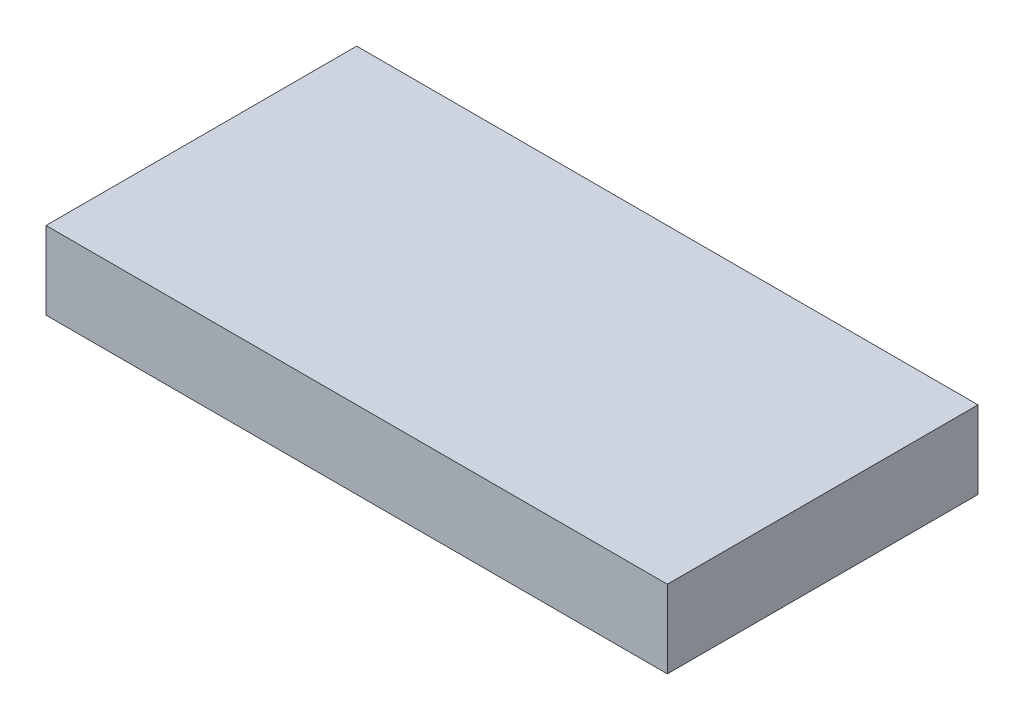
ISO-10303-21;
HEADER;
FILE_DESCRIPTION(('STEP AP214'),'2;1');
FILE_NAME('part.step','',(''),(''),'','','');
FILE_SCHEMA(('AUTOMOTIVE_DESIGN { 1 0 10303 214 1 1 1 1 }'));
ENDSEC;
DATA;
#1=APPLICATION_CONTEXT('core data for automotive mechanical design processes');
#2=APPLICATION_PROTOCOL_DEFINITION('international standard','automotive_design',2000,#1);
#3=PRODUCT_CONTEXT('',#1,'mechanical');
#4=PRODUCT('Part','Part','',(#3));
#5=PRODUCT_RELATED_PRODUCT_CATEGORY('part','',(#4));
#6=PRODUCT_DEFINITION_FORMATION('','',#4);
#7=PRODUCT_DEFINITION_CONTEXT('part definition',#1,'design');
#8=PRODUCT_DEFINITION('design','',#6,#7);
#9=PRODUCT_DEFINITION_SHAPE('','',#8);
#10=(LENGTH_UNIT() NAMED_UNIT(*) SI_UNIT(.MILLI.,.METRE.));
#11=(NAMED_UNIT(*) PLANE_ANGLE_UNIT() SI_UNIT($,.RADIAN.));
#12=(NAMED_UNIT(*) SI_UNIT($,.STERADIAN.) SOLID_ANGLE_UNIT());
#13=UNCERTAINTY_MEASURE_WITH_UNIT(LENGTH_MEASURE(1.E-05),#10,'distance_accuracy_value','');
#14=(GEOMETRIC_REPRESENTATION_CONTEXT(3) GLOBAL_UNCERTAINTY_ASSIGNED_CONTEXT((#13)) GLOBAL_UNIT_ASSIGNED_CONTEXT((#10,
#11,#12)) REPRESENTATION_CONTEXT('',''));
#15=CARTESIAN_POINT('',(0.,0.,0.));
#16=DIRECTION('',(0.,0.,1.));
#17=DIRECTION('',(1.,0.,0.));
#18=AXIS2_PLACEMENT_3D('',#15,#16,#17);
#19=CARTESIAN_POINT('',(-64.5470085470086,20.,-29.948717948718));
#20=DIRECTION('',(1.,0.,0.));
#21=DIRECTION('',(0.,0.,-1.));
#22=AXIS2_PLACEMENT_3D('',#19,#20,#21);
#23=PLANE('',#22);
#24=DIRECTION('',(0.,0.,1.));
#25=VECTOR('',#24,1.);
#26=CARTESIAN_POINT('',(-64.5470085470086,0.,-29.948717948718));
#27=LINE('',#26,#25);
#28=CARTESIAN_POINT('',(-64.5470085470086,0.,-29.948717948718));
#29=VERTEX_POINT('',#28);
#30=CARTESIAN_POINT('',(-64.5470085470085,0.,50.051282051282));
#31=VERTEX_POINT('',#30);
#32=EDGE_CURVE('E97',#29,#31,#27,.T.);
#33=ORIENTED_EDGE('',*,*,#32,.T.);
#34=DIRECTION('',(0.,-1.,0.));
#35=VECTOR('',#34,1.);
#36=CARTESIAN_POINT('',(-64.5470085470085,20.,50.051282051282));
#37=LINE('',#36,#35);
#38=CARTESIAN_POINT('',(-64.5470085470085,20.,50.051282051282));
#39=VERTEX_POINT('',#38);
#40=EDGE_CURVE('E11',#39,#31,#37,.T.);
#41=ORIENTED_EDGE('',*,*,#40,.F.);
#42=DIRECTION('',(0.,0.,1.));
#43=VECTOR('',#42,1.);
#44=CARTESIAN_POINT('',(-64.5470085470086,20.,-29.948717948718));
#45=LINE('',#44,#43);
#46=CARTESIAN_POINT('',(-64.5470085470086,20.,-29.948717948718));
#47=VERTEX_POINT('',#46);
#48=EDGE_CURVE('E85',#47,#39,#45,.T.);
#49=ORIENTED_EDGE('',*,*,#48,.F.);
#50=DIRECTION('',(0.,-1.,0.));
#51=VECTOR('',#50,1.);
#52=CARTESIAN_POINT('',(-64.5470085470086,20.,-29.948717948718));
#53=LINE('',#52,#51);
#54=EDGE_CURVE('E93',#47,#29,#53,.T.);
#55=ORIENTED_EDGE('',*,*,#54,.T.);
#56=EDGE_LOOP('',(#33,#41,#49,#55));
#57=FACE_BOUND('',#56,.T.);
#58=ADVANCED_FACE('F34',(#57),#23,.F.);
#59=CARTESIAN_POINT('',(-64.5470085470085,20.,50.051282051282));
#60=DIRECTION('',(0.,0.,-1.));
#61=DIRECTION('',(-1.,0.,0.));
#62=AXIS2_PLACEMENT_3D('',#59,#60,#61);
#63=PLANE('',#62);
#64=DIRECTION('',(1.,0.,0.));
#65=VECTOR('',#64,1.);
#66=CARTESIAN_POINT('',(-64.5470085470085,0.,50.051282051282));
#67=LINE('',#66,#65);
#68=CARTESIAN_POINT('',(95.4529914529915,0.,50.051282051282));
#69=VERTEX_POINT('',#68);
#70=EDGE_CURVE('E89',#31,#69,#67,.T.);
#71=ORIENTED_EDGE('',*,*,#70,.T.);
#72=DIRECTION('',(0.,-1.,0.));
#73=VECTOR('',#72,1.);
#74=CARTESIAN_POINT('',(95.4529914529915,20.,50.051282051282));
#75=LINE('',#74,#73);
#76=CARTESIAN_POINT('',(95.4529914529915,20.,50.051282051282));
#77=VERTEX_POINT('',#76);
#78=EDGE_CURVE('E42',#77,#69,#75,.T.);
#79=ORIENTED_EDGE('',*,*,#78,.F.);
#80=DIRECTION('',(1.,0.,0.));
#81=VECTOR('',#80,1.);
#82=CARTESIAN_POINT('',(-64.5470085470085,20.,50.051282051282));
#83=LINE('',#82,#81);
#84=EDGE_CURVE('E80',#39,#77,#83,.T.);
#85=ORIENTED_EDGE('',*,*,#84,.F.);
#86=ORIENTED_EDGE('',*,*,#40,.T.);
#87=EDGE_LOOP('',(#71,#79,#85,#86));
#88=FACE_BOUND('',#87,.T.);
#89=ADVANCED_FACE('F88',(#88),#63,.F.);
#90=CARTESIAN_POINT('',(95.4529914529915,20.,-29.948717948718));
#91=DIRECTION('',(-1.,0.,0.));
#92=DIRECTION('',(0.,0.,1.));
#93=AXIS2_PLACEMENT_3D('',#90,#91,#92);
#94=PLANE('',#93);
#95=DIRECTION('',(0.,0.,-1.));
#96=VECTOR('',#95,1.);
#97=CARTESIAN_POINT('',(95.4529914529915,0.,-29.948717948718));
#98=LINE('',#97,#96);
#99=CARTESIAN_POINT('',(95.4529914529915,0.,-29.948717948718));
#100=VERTEX_POINT('',#99);
#101=EDGE_CURVE('E67',#69,#100,#98,.T.);
#102=ORIENTED_EDGE('',*,*,#101,.T.);
#103=DIRECTION('',(0.,-1.,0.));
#104=VECTOR('',#103,1.);
#105=CARTESIAN_POINT('',(95.4529914529915,20.,-29.948717948718));
#106=LINE('',#105,#104);
#107=CARTESIAN_POINT('',(95.4529914529915,20.,-29.948717948718));
#108=VERTEX_POINT('',#107);
#109=EDGE_CURVE('E90',#108,#100,#106,.T.);
#110=ORIENTED_EDGE('',*,*,#109,.F.);
#111=DIRECTION('',(0.,0.,-1.));
#112=VECTOR('',#111,1.);
#113=CARTESIAN_POINT('',(95.4529914529915,20.,-29.948717948718));
#114=LINE('',#113,#112);
#115=EDGE_CURVE('E83',#77,#108,#114,.T.);
#116=ORIENTED_EDGE('',*,*,#115,.F.);
#117=ORIENTED_EDGE('',*,*,#78,.T.);
#118=EDGE_LOOP('',(#102,#110,#116,#117));
#119=FACE_BOUND('',#118,.T.);
#120=ADVANCED_FACE('F91',(#119),#94,.F.);
#121=CARTESIAN_POINT('',(-64.5470085470086,20.,-29.948717948718));
#122=DIRECTION('',(0.,0.,1.));
#123=DIRECTION('',(1.,0.,0.));
#124=AXIS2_PLACEMENT_3D('',#121,#122,#123);
#125=PLANE('',#124);
#126=DIRECTION('',(-1.,0.,0.));
#127=VECTOR('',#126,1.);
#128=CARTESIAN_POINT('',(-64.5470085470086,0.,-29.948717948718));
#129=LINE('',#128,#127);
#130=EDGE_CURVE('E73',#100,#29,#129,.T.);
#131=ORIENTED_EDGE('',*,*,#130,.T.);
#132=ORIENTED_EDGE('',*,*,#54,.F.);
#133=DIRECTION('',(-1.,0.,0.));
#134=VECTOR('',#133,1.);
#135=CARTESIAN_POINT('',(-64.5470085470086,20.,-29.948717948718));
#136=LINE('',#135,#134);
#137=EDGE_CURVE('E50',#108,#47,#136,.T.);
#138=ORIENTED_EDGE('',*,*,#137,.F.);
#139=ORIENTED_EDGE('',*,*,#109,.T.);
#140=EDGE_LOOP('',(#131,#132,#138,#139));
#141=FACE_BOUND('',#140,.T.);
#142=ADVANCED_FACE('F104',(#141),#125,.F.);
#143=CARTESIAN_POINT('',(0.,20.,0.));
#144=DIRECTION('',(0.,1.,0.));
#145=DIRECTION('',(0.,0.,1.));
#146=AXIS2_PLACEMENT_3D('',#143,#144,#145);
#147=PLANE('',#146);
#148=ORIENTED_EDGE('',*,*,#48,.T.);
#149=ORIENTED_EDGE('',*,*,#84,.T.);
#150=ORIENTED_EDGE('',*,*,#115,.T.);
#151=ORIENTED_EDGE('',*,*,#137,.T.);
#152=EDGE_LOOP('',(#148,#149,#150,#151));
#153=FACE_BOUND('',#152,.T.);
#154=ADVANCED_FACE('F81',(#153),#147,.T.);
#155=CARTESIAN_POINT('',(0.,0.,0.));
#156=DIRECTION('',(0.,1.,0.));
#157=DIRECTION('',(0.,0.,1.));
#158=AXIS2_PLACEMENT_3D('',#155,#156,#157);
#159=PLANE('',#158);
#160=ORIENTED_EDGE('',*,*,#32,.F.);
#161=ORIENTED_EDGE('',*,*,#130,.F.);
#162=ORIENTED_EDGE('',*,*,#101,.F.);
#163=ORIENTED_EDGE('',*,*,#70,.F.);
#164=EDGE_LOOP('',(#160,#161,#162,#163));
#165=FACE_BOUND('',#164,.T.);
#166=ADVANCED_FACE('F107',(#165),#159,.F.);
#167=CLOSED_SHELL('',(#58,#89,#120,#142,#154,#166));
#168=MANIFOLD_SOLID_BREP('B2',#167);
#169=ADVANCED_BREP_SHAPE_REPRESENTATION('',(#18,#168),#14);
#170=SHAPE_DEFINITION_REPRESENTATION(#9,#169);
ENDSEC;
END-ISO-10303-21;
